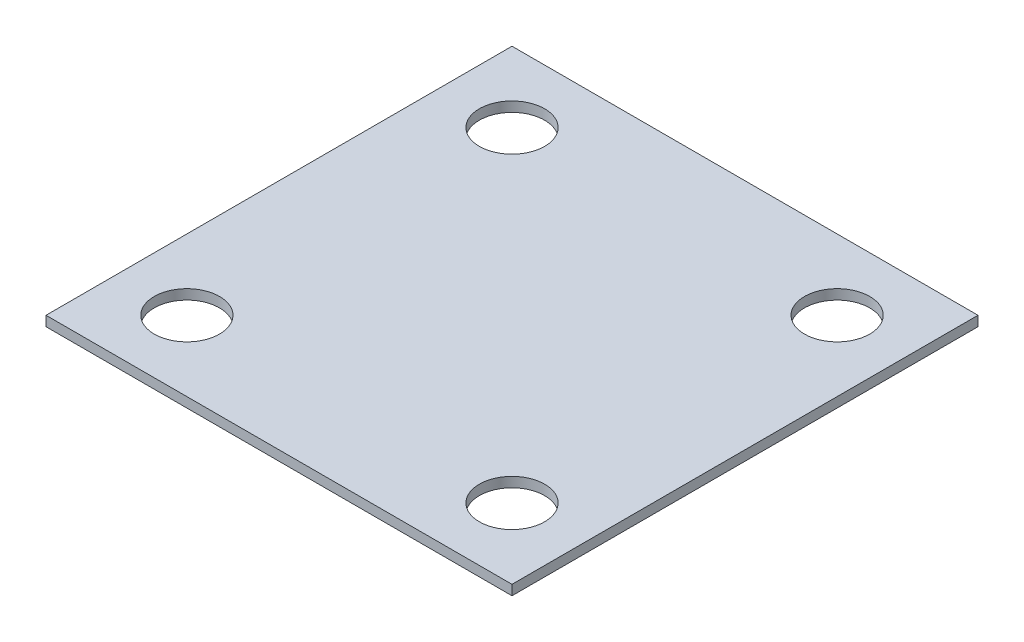
ISO-10303-21;
HEADER;
FILE_DESCRIPTION(('STEP AP214'),'2;1');
FILE_NAME('part.step','',(''),(''),'','','');
FILE_SCHEMA(('AUTOMOTIVE_DESIGN { 1 0 10303 214 1 1 1 1 }'));
ENDSEC;
DATA;
#1=APPLICATION_CONTEXT('core data for automotive mechanical design processes');
#2=APPLICATION_PROTOCOL_DEFINITION('international standard','automotive_design',2000,#1);
#3=PRODUCT_CONTEXT('',#1,'mechanical');
#4=PRODUCT('Part','Part','',(#3));
#5=PRODUCT_RELATED_PRODUCT_CATEGORY('part','',(#4));
#6=PRODUCT_DEFINITION_FORMATION('','',#4);
#7=PRODUCT_DEFINITION_CONTEXT('part definition',#1,'design');
#8=PRODUCT_DEFINITION('design','',#6,#7);
#9=PRODUCT_DEFINITION_SHAPE('','',#8);
#10=(LENGTH_UNIT() NAMED_UNIT(*) SI_UNIT(.MILLI.,.METRE.));
#11=(NAMED_UNIT(*) PLANE_ANGLE_UNIT() SI_UNIT($,.RADIAN.));
#12=(NAMED_UNIT(*) SI_UNIT($,.STERADIAN.) SOLID_ANGLE_UNIT());
#13=UNCERTAINTY_MEASURE_WITH_UNIT(LENGTH_MEASURE(1.E-05),#10,'distance_accuracy_value','');
#14=(GEOMETRIC_REPRESENTATION_CONTEXT(3) GLOBAL_UNCERTAINTY_ASSIGNED_CONTEXT((#13)) GLOBAL_UNIT_ASSIGNED_CONTEXT((#10,
#11,#12)) REPRESENTATION_CONTEXT('',''));
#15=CARTESIAN_POINT('',(0.,0.,0.));
#16=DIRECTION('',(0.,0.,1.));
#17=DIRECTION('',(1.,0.,0.));
#18=AXIS2_PLACEMENT_3D('',#15,#16,#17);
#19=CARTESIAN_POINT('',(0.,1.6,0.));
#20=DIRECTION('',(0.,-1.,0.));
#21=DIRECTION('',(0.,0.,-1.));
#22=AXIS2_PLACEMENT_3D('',#19,#20,#21);
#23=PLANE('',#22);
#24=DIRECTION('',(0.,0.,-1.));
#25=VECTOR('',#24,1.);
#26=CARTESIAN_POINT('',(37.5,1.6,37.5));
#27=LINE('',#26,#25);
#28=CARTESIAN_POINT('',(37.5,1.6,37.5));
#29=VERTEX_POINT('',#28);
#30=CARTESIAN_POINT('',(37.5,1.6,-37.5));
#31=VERTEX_POINT('',#30);
#32=EDGE_CURVE('E91',#29,#31,#27,.T.);
#33=ORIENTED_EDGE('',*,*,#32,.T.);
#34=DIRECTION('',(-1.,0.,0.));
#35=VECTOR('',#34,1.);
#36=CARTESIAN_POINT('',(-37.5,1.6,-37.5));
#37=LINE('',#36,#35);
#38=CARTESIAN_POINT('',(-37.5,1.6,-37.5));
#39=VERTEX_POINT('',#38);
#40=EDGE_CURVE('E86',#31,#39,#37,.T.);
#41=ORIENTED_EDGE('',*,*,#40,.T.);
#42=DIRECTION('',(0.,0.,1.));
#43=VECTOR('',#42,1.);
#44=CARTESIAN_POINT('',(-37.5,1.6,37.5));
#45=LINE('',#44,#43);
#46=CARTESIAN_POINT('',(-37.5,1.6,37.5));
#47=VERTEX_POINT('',#46);
#48=EDGE_CURVE('E89',#39,#47,#45,.T.);
#49=ORIENTED_EDGE('',*,*,#48,.T.);
#50=DIRECTION('',(1.,0.,0.));
#51=VECTOR('',#50,1.);
#52=CARTESIAN_POINT('',(-37.5,1.6,37.5));
#53=LINE('',#52,#51);
#54=EDGE_CURVE('E56',#47,#29,#53,.T.);
#55=ORIENTED_EDGE('',*,*,#54,.T.);
#56=EDGE_LOOP('',(#33,#41,#49,#55));
#57=FACE_BOUND('',#56,.T.);
#58=CARTESIAN_POINT('',(-26.1629,1.6,26.1629));
#59=DIRECTION('',(0.,1.,0.));
#60=DIRECTION('',(0.,0.,1.));
#61=AXIS2_PLACEMENT_3D('',#58,#59,#60);
#62=CIRCLE('',#61,5.25);
#63=CARTESIAN_POINT('',(-26.1629,1.6,31.4129));
#64=VERTEX_POINT('',#63);
#65=EDGE_CURVE('E106',#64,#64,#62,.T.);
#66=ORIENTED_EDGE('',*,*,#65,.F.);
#67=EDGE_LOOP('',(#66));
#68=FACE_BOUND('',#67,.T.);
#69=CARTESIAN_POINT('',(26.163103615411,1.6,26.1629));
#70=DIRECTION('',(0.,1.,0.));
#71=DIRECTION('',(0.,0.,1.));
#72=AXIS2_PLACEMENT_3D('',#69,#70,#71);
#73=CIRCLE('',#72,5.25);
#74=CARTESIAN_POINT('',(26.163103615411,1.6,31.4129));
#75=VERTEX_POINT('',#74);
#76=EDGE_CURVE('E121',#75,#75,#73,.T.);
#77=ORIENTED_EDGE('',*,*,#76,.F.);
#78=EDGE_LOOP('',(#77));
#79=FACE_BOUND('',#78,.T.);
#80=CARTESIAN_POINT('',(-26.1629,1.6,-26.1629));
#81=DIRECTION('',(0.,1.,0.));
#82=DIRECTION('',(0.,0.,1.));
#83=AXIS2_PLACEMENT_3D('',#80,#81,#82);
#84=CIRCLE('',#83,5.25);
#85=CARTESIAN_POINT('',(-26.1629,1.6,-20.9129));
#86=VERTEX_POINT('',#85);
#87=EDGE_CURVE('E127',#86,#86,#84,.T.);
#88=ORIENTED_EDGE('',*,*,#87,.F.);
#89=EDGE_LOOP('',(#88));
#90=FACE_BOUND('',#89,.T.);
#91=CARTESIAN_POINT('',(26.163103615411,1.6,-26.1629));
#92=DIRECTION('',(0.,1.,0.));
#93=DIRECTION('',(0.,0.,1.));
#94=AXIS2_PLACEMENT_3D('',#91,#92,#93);
#95=CIRCLE('',#94,5.25);
#96=CARTESIAN_POINT('',(26.163103615411,1.6,-20.9129));
#97=VERTEX_POINT('',#96);
#98=EDGE_CURVE('E133',#97,#97,#95,.T.);
#99=ORIENTED_EDGE('',*,*,#98,.F.);
#100=EDGE_LOOP('',(#99));
#101=FACE_BOUND('',#100,.T.);
#102=ADVANCED_FACE('F39',(#57,#68,#79,#90,#101),#23,.F.);
#103=CARTESIAN_POINT('',(0.,0.,0.));
#104=DIRECTION('',(0.,-1.,0.));
#105=DIRECTION('',(0.,0.,-1.));
#106=AXIS2_PLACEMENT_3D('',#103,#104,#105);
#107=PLANE('',#106);
#108=CARTESIAN_POINT('',(-26.1629,0.,-26.1629));
#109=DIRECTION('',(0.,1.,0.));
#110=DIRECTION('',(0.,0.,1.));
#111=AXIS2_PLACEMENT_3D('',#108,#109,#110);
#112=CIRCLE('',#111,5.25);
#113=CARTESIAN_POINT('',(-26.1629,0.,-20.9129));
#114=VERTEX_POINT('',#113);
#115=EDGE_CURVE('E130',#114,#114,#112,.T.);
#116=ORIENTED_EDGE('',*,*,#115,.T.);
#117=EDGE_LOOP('',(#116));
#118=FACE_BOUND('',#117,.T.);
#119=CARTESIAN_POINT('',(-26.1629,0.,26.1629));
#120=DIRECTION('',(0.,1.,0.));
#121=DIRECTION('',(0.,0.,1.));
#122=AXIS2_PLACEMENT_3D('',#119,#120,#121);
#123=CIRCLE('',#122,5.25);
#124=CARTESIAN_POINT('',(-26.1629,0.,31.4129));
#125=VERTEX_POINT('',#124);
#126=EDGE_CURVE('E118',#125,#125,#123,.T.);
#127=ORIENTED_EDGE('',*,*,#126,.T.);
#128=EDGE_LOOP('',(#127));
#129=FACE_BOUND('',#128,.T.);
#130=DIRECTION('',(0.,0.,-1.));
#131=VECTOR('',#130,1.);
#132=CARTESIAN_POINT('',(37.5,0.,37.5));
#133=LINE('',#132,#131);
#134=CARTESIAN_POINT('',(37.5,0.,37.5));
#135=VERTEX_POINT('',#134);
#136=CARTESIAN_POINT('',(37.5,0.,-37.5));
#137=VERTEX_POINT('',#136);
#138=EDGE_CURVE('E103',#135,#137,#133,.T.);
#139=ORIENTED_EDGE('',*,*,#138,.F.);
#140=DIRECTION('',(1.,0.,0.));
#141=VECTOR('',#140,1.);
#142=CARTESIAN_POINT('',(-37.5,0.,37.5));
#143=LINE('',#142,#141);
#144=CARTESIAN_POINT('',(-37.5,0.,37.5));
#145=VERTEX_POINT('',#144);
#146=EDGE_CURVE('E79',#145,#135,#143,.T.);
#147=ORIENTED_EDGE('',*,*,#146,.F.);
#148=DIRECTION('',(0.,0.,1.));
#149=VECTOR('',#148,1.);
#150=CARTESIAN_POINT('',(-37.5,0.,37.5));
#151=LINE('',#150,#149);
#152=CARTESIAN_POINT('',(-37.5,0.,-37.5));
#153=VERTEX_POINT('',#152);
#154=EDGE_CURVE('E73',#153,#145,#151,.T.);
#155=ORIENTED_EDGE('',*,*,#154,.F.);
#156=DIRECTION('',(-1.,0.,0.));
#157=VECTOR('',#156,1.);
#158=CARTESIAN_POINT('',(-37.5,0.,-37.5));
#159=LINE('',#158,#157);
#160=EDGE_CURVE('E95',#137,#153,#159,.T.);
#161=ORIENTED_EDGE('',*,*,#160,.F.);
#162=EDGE_LOOP('',(#139,#147,#155,#161));
#163=FACE_BOUND('',#162,.T.);
#164=CARTESIAN_POINT('',(26.163103615411,0.,26.1629));
#165=DIRECTION('',(0.,1.,0.));
#166=DIRECTION('',(0.,0.,1.));
#167=AXIS2_PLACEMENT_3D('',#164,#165,#166);
#168=CIRCLE('',#167,5.25);
#169=CARTESIAN_POINT('',(26.163103615411,0.,31.4129));
#170=VERTEX_POINT('',#169);
#171=EDGE_CURVE('E124',#170,#170,#168,.T.);
#172=ORIENTED_EDGE('',*,*,#171,.T.);
#173=EDGE_LOOP('',(#172));
#174=FACE_BOUND('',#173,.T.);
#175=CARTESIAN_POINT('',(26.163103615411,0.,-26.1629));
#176=DIRECTION('',(0.,1.,0.));
#177=DIRECTION('',(0.,0.,1.));
#178=AXIS2_PLACEMENT_3D('',#175,#176,#177);
#179=CIRCLE('',#178,5.25);
#180=CARTESIAN_POINT('',(26.163103615411,0.,-20.9129));
#181=VERTEX_POINT('',#180);
#182=EDGE_CURVE('E136',#181,#181,#179,.T.);
#183=ORIENTED_EDGE('',*,*,#182,.T.);
#184=EDGE_LOOP('',(#183));
#185=FACE_BOUND('',#184,.T.);
#186=ADVANCED_FACE('F114',(#118,#129,#163,#174,#185),#107,.T.);
#187=CARTESIAN_POINT('',(37.5,1.6,37.5));
#188=DIRECTION('',(-1.,0.,0.));
#189=DIRECTION('',(0.,0.,1.));
#190=AXIS2_PLACEMENT_3D('',#187,#188,#189);
#191=PLANE('',#190);
#192=ORIENTED_EDGE('',*,*,#138,.T.);
#193=DIRECTION('',(0.,-1.,0.));
#194=VECTOR('',#193,1.);
#195=CARTESIAN_POINT('',(37.5,1.6,-37.5));
#196=LINE('',#195,#194);
#197=EDGE_CURVE('E11',#31,#137,#196,.T.);
#198=ORIENTED_EDGE('',*,*,#197,.F.);
#199=ORIENTED_EDGE('',*,*,#32,.F.);
#200=DIRECTION('',(0.,-1.,0.));
#201=VECTOR('',#200,1.);
#202=CARTESIAN_POINT('',(37.5,1.6,37.5));
#203=LINE('',#202,#201);
#204=EDGE_CURVE('E99',#29,#135,#203,.T.);
#205=ORIENTED_EDGE('',*,*,#204,.T.);
#206=EDGE_LOOP('',(#192,#198,#199,#205));
#207=FACE_BOUND('',#206,.T.);
#208=ADVANCED_FACE('F41',(#207),#191,.F.);
#209=CARTESIAN_POINT('',(-37.5,1.6,-37.5));
#210=DIRECTION('',(0.,0.,1.));
#211=DIRECTION('',(1.,0.,0.));
#212=AXIS2_PLACEMENT_3D('',#209,#210,#211);
#213=PLANE('',#212);
#214=ORIENTED_EDGE('',*,*,#160,.T.);
#215=DIRECTION('',(0.,-1.,0.));
#216=VECTOR('',#215,1.);
#217=CARTESIAN_POINT('',(-37.5,1.6,-37.5));
#218=LINE('',#217,#216);
#219=EDGE_CURVE('E48',#39,#153,#218,.T.);
#220=ORIENTED_EDGE('',*,*,#219,.F.);
#221=ORIENTED_EDGE('',*,*,#40,.F.);
#222=ORIENTED_EDGE('',*,*,#197,.T.);
#223=EDGE_LOOP('',(#214,#220,#221,#222));
#224=FACE_BOUND('',#223,.T.);
#225=ADVANCED_FACE('F94',(#224),#213,.F.);
#226=CARTESIAN_POINT('',(-37.5,1.6,37.5));
#227=DIRECTION('',(1.,0.,0.));
#228=DIRECTION('',(0.,0.,-1.));
#229=AXIS2_PLACEMENT_3D('',#226,#227,#228);
#230=PLANE('',#229);
#231=ORIENTED_EDGE('',*,*,#154,.T.);
#232=DIRECTION('',(0.,-1.,0.));
#233=VECTOR('',#232,1.);
#234=CARTESIAN_POINT('',(-37.5,1.6,37.5));
#235=LINE('',#234,#233);
#236=EDGE_CURVE('E96',#47,#145,#235,.T.);
#237=ORIENTED_EDGE('',*,*,#236,.F.);
#238=ORIENTED_EDGE('',*,*,#48,.F.);
#239=ORIENTED_EDGE('',*,*,#219,.T.);
#240=EDGE_LOOP('',(#231,#237,#238,#239));
#241=FACE_BOUND('',#240,.T.);
#242=ADVANCED_FACE('F97',(#241),#230,.F.);
#243=CARTESIAN_POINT('',(-37.5,1.6,37.5));
#244=DIRECTION('',(0.,0.,-1.));
#245=DIRECTION('',(-1.,0.,0.));
#246=AXIS2_PLACEMENT_3D('',#243,#244,#245);
#247=PLANE('',#246);
#248=ORIENTED_EDGE('',*,*,#146,.T.);
#249=ORIENTED_EDGE('',*,*,#204,.F.);
#250=ORIENTED_EDGE('',*,*,#54,.F.);
#251=ORIENTED_EDGE('',*,*,#236,.T.);
#252=EDGE_LOOP('',(#248,#249,#250,#251));
#253=FACE_BOUND('',#252,.T.);
#254=ADVANCED_FACE('F111',(#253),#247,.F.);
#255=CARTESIAN_POINT('',(-26.1629,1.6,26.1629));
#256=DIRECTION('',(0.,-1.,0.));
#257=DIRECTION('',(0.,0.,-1.));
#258=AXIS2_PLACEMENT_3D('',#255,#256,#257);
#259=CYLINDRICAL_SURFACE('',#258,5.25);
#260=ORIENTED_EDGE('',*,*,#65,.T.);
#261=EDGE_LOOP('',(#260));
#262=FACE_BOUND('',#261,.T.);
#263=ORIENTED_EDGE('',*,*,#126,.F.);
#264=EDGE_LOOP('',(#263));
#265=FACE_BOUND('',#264,.T.);
#266=ADVANCED_FACE('F153',(#262,#265),#259,.F.);
#267=CARTESIAN_POINT('',(26.163103615411,1.6,26.1629));
#268=DIRECTION('',(0.,-1.,0.));
#269=DIRECTION('',(0.,0.,-1.));
#270=AXIS2_PLACEMENT_3D('',#267,#268,#269);
#271=CYLINDRICAL_SURFACE('',#270,5.25);
#272=ORIENTED_EDGE('',*,*,#76,.T.);
#273=EDGE_LOOP('',(#272));
#274=FACE_BOUND('',#273,.T.);
#275=ORIENTED_EDGE('',*,*,#171,.F.);
#276=EDGE_LOOP('',(#275));
#277=FACE_BOUND('',#276,.T.);
#278=ADVANCED_FACE('F199',(#274,#277),#271,.F.);
#279=CARTESIAN_POINT('',(-26.1629,1.6,-26.1629));
#280=DIRECTION('',(0.,-1.,0.));
#281=DIRECTION('',(0.,0.,-1.));
#282=AXIS2_PLACEMENT_3D('',#279,#280,#281);
#283=CYLINDRICAL_SURFACE('',#282,5.25);
#284=ORIENTED_EDGE('',*,*,#87,.T.);
#285=EDGE_LOOP('',(#284));
#286=FACE_BOUND('',#285,.T.);
#287=ORIENTED_EDGE('',*,*,#115,.F.);
#288=EDGE_LOOP('',(#287));
#289=FACE_BOUND('',#288,.T.);
#290=ADVANCED_FACE('F207',(#286,#289),#283,.F.);
#291=CARTESIAN_POINT('',(26.163103615411,1.6,-26.1629));
#292=DIRECTION('',(0.,-1.,0.));
#293=DIRECTION('',(0.,0.,-1.));
#294=AXIS2_PLACEMENT_3D('',#291,#292,#293);
#295=CYLINDRICAL_SURFACE('',#294,5.25);
#296=ORIENTED_EDGE('',*,*,#98,.T.);
#297=EDGE_LOOP('',(#296));
#298=FACE_BOUND('',#297,.T.);
#299=ORIENTED_EDGE('',*,*,#182,.F.);
#300=EDGE_LOOP('',(#299));
#301=FACE_BOUND('',#300,.T.);
#302=ADVANCED_FACE('F142',(#298,#301),#295,.F.);
#303=CLOSED_SHELL('',(#102,#186,#208,#225,#242,#254,#266,#278,#290,#302));
#304=MANIFOLD_SOLID_BREP('B2',#303);
#305=ADVANCED_BREP_SHAPE_REPRESENTATION('',(#18,#304),#14);
#306=SHAPE_DEFINITION_REPRESENTATION(#9,#305);
ENDSEC;
END-ISO-10303-21;
